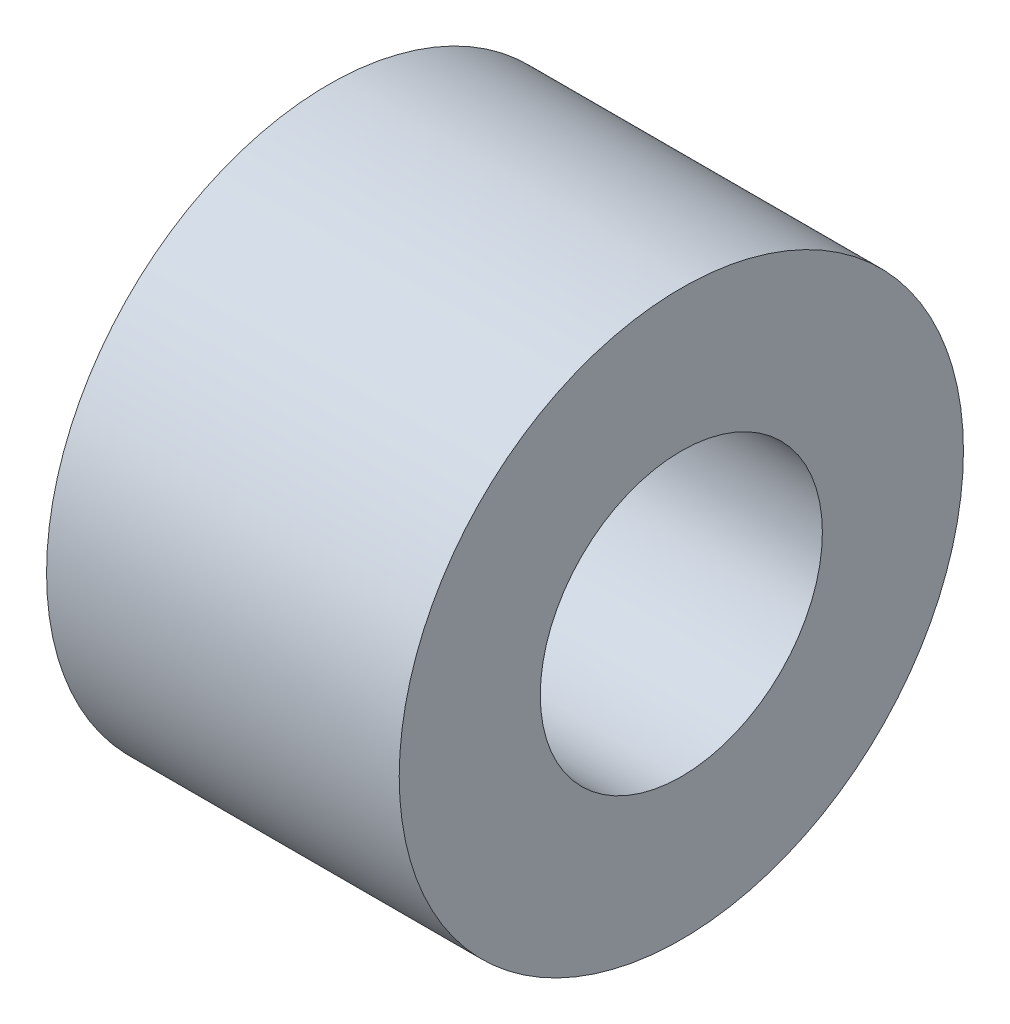
ISO-10303-21;
HEADER;
FILE_DESCRIPTION(('STEP AP214'),'2;1');
FILE_NAME('part.step','',(''),(''),'','','');
FILE_SCHEMA(('AUTOMOTIVE_DESIGN { 1 0 10303 214 1 1 1 1 }'));
ENDSEC;
DATA;
#1=APPLICATION_CONTEXT('core data for automotive mechanical design processes');
#2=APPLICATION_PROTOCOL_DEFINITION('international standard','automotive_design',2000,#1);
#3=PRODUCT_CONTEXT('',#1,'mechanical');
#4=PRODUCT('Part','Part','',(#3));
#5=PRODUCT_RELATED_PRODUCT_CATEGORY('part','',(#4));
#6=PRODUCT_DEFINITION_FORMATION('','',#4);
#7=PRODUCT_DEFINITION_CONTEXT('part definition',#1,'design');
#8=PRODUCT_DEFINITION('design','',#6,#7);
#9=PRODUCT_DEFINITION_SHAPE('','',#8);
#10=(LENGTH_UNIT() NAMED_UNIT(*) SI_UNIT(.MILLI.,.METRE.));
#11=(NAMED_UNIT(*) PLANE_ANGLE_UNIT() SI_UNIT($,.RADIAN.));
#12=(NAMED_UNIT(*) SI_UNIT($,.STERADIAN.) SOLID_ANGLE_UNIT());
#13=UNCERTAINTY_MEASURE_WITH_UNIT(LENGTH_MEASURE(1.E-05),#10,'distance_accuracy_value','');
#14=(GEOMETRIC_REPRESENTATION_CONTEXT(3) GLOBAL_UNCERTAINTY_ASSIGNED_CONTEXT((#13)) GLOBAL_UNIT_ASSIGNED_CONTEXT((#10,
#11,#12)) REPRESENTATION_CONTEXT('',''));
#15=CARTESIAN_POINT('',(0.,0.,0.));
#16=DIRECTION('',(0.,0.,1.));
#17=DIRECTION('',(1.,0.,0.));
#18=AXIS2_PLACEMENT_3D('',#15,#16,#17);
#19=CARTESIAN_POINT('',(0.,-4.,0.));
#20=DIRECTION('',(-1.,0.,0.));
#21=DIRECTION('',(0.,0.,1.));
#22=AXIS2_PLACEMENT_3D('',#19,#20,#21);
#23=PLANE('',#22);
#24=CARTESIAN_POINT('',(0.,0.,0.));
#25=DIRECTION('',(-1.,0.,0.));
#26=DIRECTION('',(0.,0.,1.));
#27=AXIS2_PLACEMENT_3D('',#24,#25,#26);
#28=CIRCLE('',#27,4.);
#29=CARTESIAN_POINT('',(0.,0.,4.));
#30=VERTEX_POINT('',#29);
#31=EDGE_CURVE('E45',#30,#30,#28,.T.);
#32=ORIENTED_EDGE('',*,*,#31,.T.);
#33=EDGE_LOOP('',(#32));
#34=FACE_BOUND('',#33,.T.);
#35=CARTESIAN_POINT('',(0.,0.,0.));
#36=DIRECTION('',(-1.,0.,0.));
#37=DIRECTION('',(0.,0.,1.));
#38=AXIS2_PLACEMENT_3D('',#35,#36,#37);
#39=CIRCLE('',#38,2.);
#40=CARTESIAN_POINT('',(0.,0.,2.));
#41=VERTEX_POINT('',#40);
#42=EDGE_CURVE('E10',#41,#41,#39,.T.);
#43=ORIENTED_EDGE('',*,*,#42,.F.);
#44=EDGE_LOOP('',(#43));
#45=FACE_BOUND('',#44,.T.);
#46=ADVANCED_FACE('F31',(#34,#45),#23,.T.);
#47=CARTESIAN_POINT('',(0.,0.,0.));
#48=DIRECTION('',(-1.,0.,0.));
#49=DIRECTION('',(0.,0.,1.));
#50=AXIS2_PLACEMENT_3D('',#47,#48,#49);
#51=CYLINDRICAL_SURFACE('',#50,2.);
#52=ORIENTED_EDGE('',*,*,#42,.T.);
#53=EDGE_LOOP('',(#52));
#54=FACE_BOUND('',#53,.T.);
#55=CARTESIAN_POINT('',(5.,0.,0.));
#56=DIRECTION('',(-1.,0.,0.));
#57=DIRECTION('',(0.,0.,1.));
#58=AXIS2_PLACEMENT_3D('',#55,#56,#57);
#59=CIRCLE('',#58,2.);
#60=CARTESIAN_POINT('',(5.,0.,2.));
#61=VERTEX_POINT('',#60);
#62=EDGE_CURVE('E37',#61,#61,#59,.T.);
#63=ORIENTED_EDGE('',*,*,#62,.F.);
#64=EDGE_LOOP('',(#63));
#65=FACE_BOUND('',#64,.T.);
#66=ADVANCED_FACE('F61',(#54,#65),#51,.F.);
#67=CARTESIAN_POINT('',(5.,-2.,0.));
#68=DIRECTION('',(1.,0.,0.));
#69=DIRECTION('',(0.,0.,-1.));
#70=AXIS2_PLACEMENT_3D('',#67,#68,#69);
#71=PLANE('',#70);
#72=ORIENTED_EDGE('',*,*,#62,.T.);
#73=EDGE_LOOP('',(#72));
#74=FACE_BOUND('',#73,.T.);
#75=CARTESIAN_POINT('',(5.,0.,0.));
#76=DIRECTION('',(-1.,0.,0.));
#77=DIRECTION('',(0.,0.,1.));
#78=AXIS2_PLACEMENT_3D('',#75,#76,#77);
#79=CIRCLE('',#78,4.);
#80=CARTESIAN_POINT('',(5.,0.,4.));
#81=VERTEX_POINT('',#80);
#82=EDGE_CURVE('E41',#81,#81,#79,.T.);
#83=ORIENTED_EDGE('',*,*,#82,.F.);
#84=EDGE_LOOP('',(#83));
#85=FACE_BOUND('',#84,.T.);
#86=ADVANCED_FACE('F55',(#74,#85),#71,.T.);
#87=CARTESIAN_POINT('',(0.,0.,0.));
#88=DIRECTION('',(-1.,0.,0.));
#89=DIRECTION('',(0.,0.,1.));
#90=AXIS2_PLACEMENT_3D('',#87,#88,#89);
#91=CYLINDRICAL_SURFACE('',#90,4.);
#92=ORIENTED_EDGE('',*,*,#82,.T.);
#93=EDGE_LOOP('',(#92));
#94=FACE_BOUND('',#93,.T.);
#95=ORIENTED_EDGE('',*,*,#31,.F.);
#96=EDGE_LOOP('',(#95));
#97=FACE_BOUND('',#96,.T.);
#98=ADVANCED_FACE('F53',(#94,#97),#91,.T.);
#99=CLOSED_SHELL('',(#46,#66,#86,#98));
#100=MANIFOLD_SOLID_BREP('B2',#99);
#101=ADVANCED_BREP_SHAPE_REPRESENTATION('',(#18,#100),#14);
#102=SHAPE_DEFINITION_REPRESENTATION(#9,#101);
ENDSEC;
END-ISO-10303-21;
